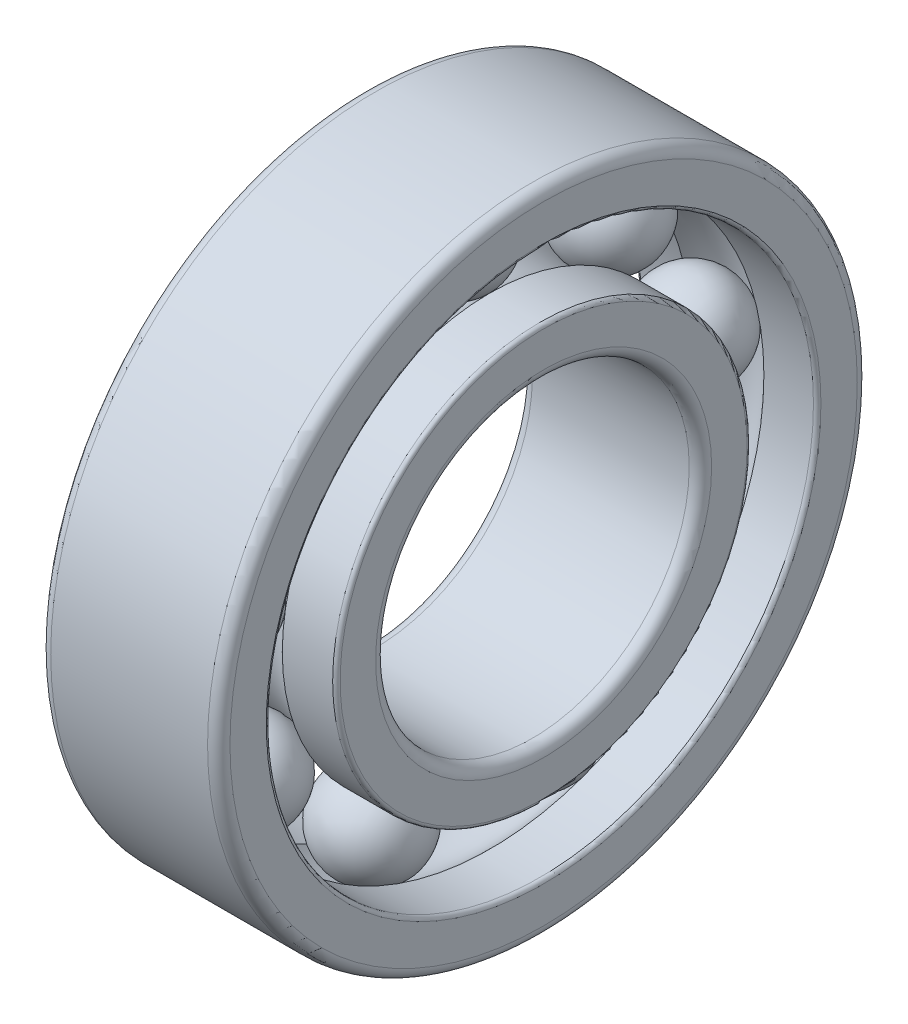
ISO-10303-21;
HEADER;
FILE_DESCRIPTION(('STEP AP214'),'2;1');
FILE_NAME('part.step','',(''),(''),'','','');
FILE_SCHEMA(('AUTOMOTIVE_DESIGN { 1 0 10303 214 1 1 1 1 }'));
ENDSEC;
DATA;
#1=APPLICATION_CONTEXT('core data for automotive mechanical design processes');
#2=APPLICATION_PROTOCOL_DEFINITION('international standard','automotive_design',2000,#1);
#3=PRODUCT_CONTEXT('',#1,'mechanical');
#4=PRODUCT('Part','Part','',(#3));
#5=PRODUCT_RELATED_PRODUCT_CATEGORY('part','',(#4));
#6=PRODUCT_DEFINITION_FORMATION('','',#4);
#7=PRODUCT_DEFINITION_CONTEXT('part definition',#1,'design');
#8=PRODUCT_DEFINITION('design','',#6,#7);
#9=PRODUCT_DEFINITION_SHAPE('','',#8);
#10=(LENGTH_UNIT() NAMED_UNIT(*) SI_UNIT(.MILLI.,.METRE.));
#11=(NAMED_UNIT(*) PLANE_ANGLE_UNIT() SI_UNIT($,.RADIAN.));
#12=(NAMED_UNIT(*) SI_UNIT($,.STERADIAN.) SOLID_ANGLE_UNIT());
#13=UNCERTAINTY_MEASURE_WITH_UNIT(LENGTH_MEASURE(1.E-05),#10,'distance_accuracy_value','');
#14=(GEOMETRIC_REPRESENTATION_CONTEXT(3) GLOBAL_UNCERTAINTY_ASSIGNED_CONTEXT((#13)) GLOBAL_UNIT_ASSIGNED_CONTEXT((#10,
#11,#12)) REPRESENTATION_CONTEXT('',''));
#15=CARTESIAN_POINT('',(0.,0.,0.));
#16=DIRECTION('',(0.,0.,1.));
#17=DIRECTION('',(1.,0.,0.));
#18=AXIS2_PLACEMENT_3D('',#15,#16,#17);
#19=CARTESIAN_POINT('',(0.,18.1666666666667,0.));
#20=DIRECTION('',(-1.,0.,0.));
#21=DIRECTION('',(0.,0.,1.));
#22=AXIS2_PLACEMENT_3D('',#19,#20,#21);
#23=PLANE('',#22);
#24=CARTESIAN_POINT('',(0.,0.,0.));
#25=DIRECTION('',(1.,0.,0.));
#26=DIRECTION('',(0.,0.,-1.));
#27=AXIS2_PLACEMENT_3D('',#24,#25,#26);
#28=CIRCLE('',#27,18.1666666667);
#29=CARTESIAN_POINT('',(0.,0.,-18.1666666666667));
#30=VERTEX_POINT('',#29);
#31=EDGE_CURVE('P0_E39',#30,#30,#28,.T.);
#32=ORIENTED_EDGE('',*,*,#31,.F.);
#33=EDGE_LOOP('',(#32));
#34=FACE_BOUND('',#33,.T.);
#35=CARTESIAN_POINT('',(0.,0.,0.));
#36=DIRECTION('',(1.,0.,0.));
#37=DIRECTION('',(0.,0.,-1.));
#38=AXIS2_PLACEMENT_3D('',#35,#36,#37);
#39=CIRCLE('',#38,15.);
#40=CARTESIAN_POINT('',(0.,0.,-15.));
#41=VERTEX_POINT('',#40);
#42=EDGE_CURVE('P0_E11',#41,#41,#39,.T.);
#43=ORIENTED_EDGE('',*,*,#42,.T.);
#44=EDGE_LOOP('',(#43));
#45=FACE_BOUND('',#44,.T.);
#46=ADVANCED_FACE('P0_F16',(#34,#45),#23,.T.);
#47=CARTESIAN_POINT('',(1.,0.,0.));
#48=DIRECTION('',(1.,0.,0.));
#49=DIRECTION('',(0.,0.,-1.));
#50=AXIS2_PLACEMENT_3D('',#47,#48,#49);
#51=TOROIDAL_SURFACE('',#50,15.,1.);
#52=ORIENTED_EDGE('',*,*,#42,.F.);
#53=EDGE_LOOP('',(#52));
#54=FACE_BOUND('',#53,.T.);
#55=CARTESIAN_POINT('',(1.,0.,0.));
#56=DIRECTION('',(1.,0.,0.));
#57=DIRECTION('',(0.,0.,-1.));
#58=AXIS2_PLACEMENT_3D('',#55,#56,#57);
#59=CIRCLE('',#58,14.);
#60=CARTESIAN_POINT('',(1.,0.,-14.));
#61=VERTEX_POINT('',#60);
#62=EDGE_CURVE('P0_E27',#61,#61,#59,.T.);
#63=ORIENTED_EDGE('',*,*,#62,.T.);
#64=EDGE_LOOP('',(#63));
#65=FACE_BOUND('',#64,.T.);
#66=ADVANCED_FACE('P0_F18',(#54,#65),#51,.T.);
#67=CARTESIAN_POINT('',(100.,0.,0.));
#68=DIRECTION('',(-1.,0.,0.));
#69=DIRECTION('',(0.,0.,-1.));
#70=AXIS2_PLACEMENT_3D('',#67,#68,#69);
#71=CYLINDRICAL_SURFACE('',#70,14.);
#72=ORIENTED_EDGE('',*,*,#62,.F.);
#73=EDGE_LOOP('',(#72));
#74=FACE_BOUND('',#73,.T.);
#75=CARTESIAN_POINT('',(15.,0.,0.));
#76=DIRECTION('',(1.,0.,0.));
#77=DIRECTION('',(0.,0.,-1.));
#78=AXIS2_PLACEMENT_3D('',#75,#76,#77);
#79=CIRCLE('',#78,14.);
#80=CARTESIAN_POINT('',(15.,0.,-14.));
#81=VERTEX_POINT('',#80);
#82=EDGE_CURVE('P0_E77',#81,#81,#79,.T.);
#83=ORIENTED_EDGE('',*,*,#82,.T.);
#84=EDGE_LOOP('',(#83));
#85=FACE_BOUND('',#84,.T.);
#86=ADVANCED_FACE('P0_F73',(#74,#85),#71,.F.);
#87=CARTESIAN_POINT('',(15.,0.,0.));
#88=DIRECTION('',(1.,0.,0.));
#89=DIRECTION('',(0.,0.,-1.));
#90=AXIS2_PLACEMENT_3D('',#87,#88,#89);
#91=TOROIDAL_SURFACE('',#90,15.,1.);
#92=ORIENTED_EDGE('',*,*,#82,.F.);
#93=EDGE_LOOP('',(#92));
#94=FACE_BOUND('',#93,.T.);
#95=CARTESIAN_POINT('',(16.,0.,0.));
#96=DIRECTION('',(1.,0.,0.));
#97=DIRECTION('',(0.,0.,-1.));
#98=AXIS2_PLACEMENT_3D('',#95,#96,#97);
#99=CIRCLE('',#98,15.);
#100=CARTESIAN_POINT('',(16.,0.,-15.));
#101=VERTEX_POINT('',#100);
#102=EDGE_CURVE('P0_E83',#101,#101,#99,.T.);
#103=ORIENTED_EDGE('',*,*,#102,.T.);
#104=EDGE_LOOP('',(#103));
#105=FACE_BOUND('',#104,.T.);
#106=ADVANCED_FACE('P0_F130',(#94,#105),#91,.T.);
#107=CARTESIAN_POINT('',(16.,15.,0.));
#108=DIRECTION('',(1.,0.,0.));
#109=DIRECTION('',(0.,1.,0.));
#110=AXIS2_PLACEMENT_3D('',#107,#108,#109);
#111=PLANE('',#110);
#112=CARTESIAN_POINT('',(16.,0.,0.));
#113=DIRECTION('',(1.,0.,0.));
#114=DIRECTION('',(0.,0.,-1.));
#115=AXIS2_PLACEMENT_3D('',#112,#113,#114);
#116=CIRCLE('',#115,18.1666666667);
#117=CARTESIAN_POINT('',(16.,0.,-18.1666666666667));
#118=VERTEX_POINT('',#117);
#119=EDGE_CURVE('P0_E94',#118,#118,#116,.T.);
#120=ORIENTED_EDGE('',*,*,#119,.T.);
#121=EDGE_LOOP('',(#120));
#122=FACE_BOUND('',#121,.T.);
#123=ORIENTED_EDGE('',*,*,#102,.F.);
#124=EDGE_LOOP('',(#123));
#125=FACE_BOUND('',#124,.T.);
#126=ADVANCED_FACE('P0_F134',(#122,#125),#111,.T.);
#127=CARTESIAN_POINT('',(15.6666666666667,0.,0.));
#128=DIRECTION('',(1.,0.,0.));
#129=DIRECTION('',(0.,0.,-1.));
#130=AXIS2_PLACEMENT_3D('',#127,#128,#129);
#131=TOROIDAL_SURFACE('',#130,18.1666666667,0.3333333333);
#132=ORIENTED_EDGE('',*,*,#119,.F.);
#133=EDGE_LOOP('',(#132));
#134=FACE_BOUND('',#133,.T.);
#135=CARTESIAN_POINT('',(15.6666666666667,0.,0.));
#136=DIRECTION('',(1.,0.,0.));
#137=DIRECTION('',(0.,0.,-1.));
#138=AXIS2_PLACEMENT_3D('',#135,#136,#137);
#139=CIRCLE('',#138,18.5);
#140=CARTESIAN_POINT('',(15.6666666666667,0.,-18.5));
#141=VERTEX_POINT('',#140);
#142=EDGE_CURVE('P0_E90',#141,#141,#139,.T.);
#143=ORIENTED_EDGE('',*,*,#142,.T.);
#144=EDGE_LOOP('',(#143));
#145=FACE_BOUND('',#144,.T.);
#146=ADVANCED_FACE('P0_F131',(#134,#145),#131,.T.);
#147=CARTESIAN_POINT('',(100.,0.,0.));
#148=DIRECTION('',(-1.,0.,0.));
#149=DIRECTION('',(0.,0.,-1.));
#150=AXIS2_PLACEMENT_3D('',#147,#148,#149);
#151=CYLINDRICAL_SURFACE('',#150,18.5);
#152=ORIENTED_EDGE('',*,*,#142,.F.);
#153=EDGE_LOOP('',(#152));
#154=FACE_BOUND('',#153,.T.);
#155=CARTESIAN_POINT('',(11.1713704056764,0.,0.));
#156=DIRECTION('',(1.,0.,0.));
#157=DIRECTION('',(0.,0.,-1.));
#158=AXIS2_PLACEMENT_3D('',#155,#156,#157);
#159=CIRCLE('',#158,18.5);
#160=CARTESIAN_POINT('',(11.1713704056764,0.,-18.5));
#161=VERTEX_POINT('',#160);
#162=EDGE_CURVE('P0_E20',#161,#161,#159,.T.);
#163=ORIENTED_EDGE('',*,*,#162,.T.);
#164=EDGE_LOOP('',(#163));
#165=FACE_BOUND('',#164,.T.);
#166=ADVANCED_FACE('P0_F133',(#154,#165),#151,.T.);
#167=CARTESIAN_POINT('',(8.,0.,0.));
#168=DIRECTION('',(1.,0.,0.));
#169=DIRECTION('',(0.,0.,-1.));
#170=AXIS2_PLACEMENT_3D('',#167,#168,#169);
#171=TOROIDAL_SURFACE('',#170,21.5,4.3655);
#172=CARTESIAN_POINT('',(4.82862959432362,0.,0.));
#173=DIRECTION('',(1.,0.,0.));
#174=DIRECTION('',(0.,0.,-1.));
#175=AXIS2_PLACEMENT_3D('',#172,#173,#174);
#176=CIRCLE('',#175,18.5);
#177=CARTESIAN_POINT('',(4.82862959432362,0.,-18.5));
#178=VERTEX_POINT('',#177);
#179=EDGE_CURVE('P0_E86',#178,#178,#176,.T.);
#180=ORIENTED_EDGE('',*,*,#179,.T.);
#181=EDGE_LOOP('',(#180));
#182=FACE_BOUND('',#181,.T.);
#183=ORIENTED_EDGE('',*,*,#162,.F.);
#184=EDGE_LOOP('',(#183));
#185=FACE_BOUND('',#184,.T.);
#186=ADVANCED_FACE('P0_F117',(#182,#185),#171,.F.);
#187=CARTESIAN_POINT('',(100.,0.,0.));
#188=DIRECTION('',(-1.,0.,0.));
#189=DIRECTION('',(0.,0.,-1.));
#190=AXIS2_PLACEMENT_3D('',#187,#188,#189);
#191=CYLINDRICAL_SURFACE('',#190,18.5);
#192=ORIENTED_EDGE('',*,*,#179,.F.);
#193=EDGE_LOOP('',(#192));
#194=FACE_BOUND('',#193,.T.);
#195=CARTESIAN_POINT('',(0.333333333333338,0.,0.));
#196=DIRECTION('',(1.,0.,0.));
#197=DIRECTION('',(0.,0.,-1.));
#198=AXIS2_PLACEMENT_3D('',#195,#196,#197);
#199=CIRCLE('',#198,18.5);
#200=CARTESIAN_POINT('',(0.333333333333338,0.,-18.5));
#201=VERTEX_POINT('',#200);
#202=EDGE_CURVE('P0_E89',#201,#201,#199,.T.);
#203=ORIENTED_EDGE('',*,*,#202,.T.);
#204=EDGE_LOOP('',(#203));
#205=FACE_BOUND('',#204,.T.);
#206=ADVANCED_FACE('P0_F109',(#194,#205),#191,.T.);
#207=CARTESIAN_POINT('',(0.333333333333323,0.,0.));
#208=DIRECTION('',(1.,0.,0.));
#209=DIRECTION('',(0.,0.,-1.));
#210=AXIS2_PLACEMENT_3D('',#207,#208,#209);
#211=TOROIDAL_SURFACE('',#210,18.1666666667,0.3333333333);
#212=ORIENTED_EDGE('',*,*,#202,.F.);
#213=EDGE_LOOP('',(#212));
#214=FACE_BOUND('',#213,.T.);
#215=ORIENTED_EDGE('',*,*,#31,.T.);
#216=EDGE_LOOP('',(#215));
#217=FACE_BOUND('',#216,.T.);
#218=ADVANCED_FACE('P0_F107',(#214,#217),#211,.T.);
#219=CLOSED_SHELL('',(#46,#66,#86,#106,#126,#146,#166,#186,#206,#218));
#220=MANIFOLD_SOLID_BREP('P0_B1',#219);
#221=CARTESIAN_POINT('',(1.,0.,0.));
#222=DIRECTION('',(1.,0.,0.));
#223=DIRECTION('',(0.,0.,-1.));
#224=AXIS2_PLACEMENT_3D('',#221,#222,#223);
#225=TOROIDAL_SURFACE('',#224,28.,1.);
#226=CARTESIAN_POINT('',(1.,0.,0.));
#227=DIRECTION('',(1.,0.,0.));
#228=DIRECTION('',(0.,0.,-1.));
#229=AXIS2_PLACEMENT_3D('',#226,#227,#228);
#230=CIRCLE('',#229,29.);
#231=CARTESIAN_POINT('',(1.,0.,-29.));
#232=VERTEX_POINT('',#231);
#233=EDGE_CURVE('P1_E39',#232,#232,#230,.T.);
#234=ORIENTED_EDGE('',*,*,#233,.F.);
#235=EDGE_LOOP('',(#234));
#236=FACE_BOUND('',#235,.T.);
#237=CARTESIAN_POINT('',(0.,0.,0.));
#238=DIRECTION('',(1.,0.,0.));
#239=DIRECTION('',(0.,0.,-1.));
#240=AXIS2_PLACEMENT_3D('',#237,#238,#239);
#241=CIRCLE('',#240,28.);
#242=CARTESIAN_POINT('',(0.,0.,-28.));
#243=VERTEX_POINT('',#242);
#244=EDGE_CURVE('P1_E11',#243,#243,#241,.T.);
#245=ORIENTED_EDGE('',*,*,#244,.T.);
#246=EDGE_LOOP('',(#245));
#247=FACE_BOUND('',#246,.T.);
#248=ADVANCED_FACE('P1_F16',(#236,#247),#225,.T.);
#249=CARTESIAN_POINT('',(0.,28.,0.));
#250=DIRECTION('',(-1.,0.,0.));
#251=DIRECTION('',(0.,0.,1.));
#252=AXIS2_PLACEMENT_3D('',#249,#250,#251);
#253=PLANE('',#252);
#254=ORIENTED_EDGE('',*,*,#244,.F.);
#255=EDGE_LOOP('',(#254));
#256=FACE_BOUND('',#255,.T.);
#257=CARTESIAN_POINT('',(0.,0.,0.));
#258=DIRECTION('',(1.,0.,0.));
#259=DIRECTION('',(0.,0.,-1.));
#260=AXIS2_PLACEMENT_3D('',#257,#258,#259);
#261=CIRCLE('',#260,24.7583333333);
#262=CARTESIAN_POINT('',(0.,0.,-24.7583333333333));
#263=VERTEX_POINT('',#262);
#264=EDGE_CURVE('P1_E27',#263,#263,#261,.T.);
#265=ORIENTED_EDGE('',*,*,#264,.T.);
#266=EDGE_LOOP('',(#265));
#267=FACE_BOUND('',#266,.T.);
#268=ADVANCED_FACE('P1_F127',(#256,#267),#253,.T.);
#269=CARTESIAN_POINT('',(0.333333333333335,0.,0.));
#270=DIRECTION('',(1.,0.,0.));
#271=DIRECTION('',(0.,0.,-1.));
#272=AXIS2_PLACEMENT_3D('',#269,#270,#271);
#273=TOROIDAL_SURFACE('',#272,24.7583333333,0.3333333333);
#274=ORIENTED_EDGE('',*,*,#264,.F.);
#275=EDGE_LOOP('',(#274));
#276=FACE_BOUND('',#275,.T.);
#277=CARTESIAN_POINT('',(0.333333333333331,0.,0.));
#278=DIRECTION('',(1.,0.,0.));
#279=DIRECTION('',(0.,0.,-1.));
#280=AXIS2_PLACEMENT_3D('',#277,#278,#279);
#281=CIRCLE('',#280,24.425);
#282=CARTESIAN_POINT('',(0.333333333333331,0.,-24.425));
#283=VERTEX_POINT('',#282);
#284=EDGE_CURVE('P1_E85',#283,#283,#281,.T.);
#285=ORIENTED_EDGE('',*,*,#284,.T.);
#286=EDGE_LOOP('',(#285));
#287=FACE_BOUND('',#286,.T.);
#288=ADVANCED_FACE('P1_F18',(#276,#287),#273,.T.);
#289=CARTESIAN_POINT('',(50.,0.,0.));
#290=DIRECTION('',(-1.,0.,0.));
#291=DIRECTION('',(0.,0.,-1.));
#292=AXIS2_PLACEMENT_3D('',#289,#290,#291);
#293=CYLINDRICAL_SURFACE('',#292,24.425);
#294=ORIENTED_EDGE('',*,*,#284,.F.);
#295=EDGE_LOOP('',(#294));
#296=FACE_BOUND('',#295,.T.);
#297=CARTESIAN_POINT('',(4.75932642032555,0.,0.));
#298=DIRECTION('',(1.,0.,0.));
#299=DIRECTION('',(0.,0.,-1.));
#300=AXIS2_PLACEMENT_3D('',#297,#298,#299);
#301=CIRCLE('',#300,24.425);
#302=CARTESIAN_POINT('',(4.75932642032555,0.,-24.425));
#303=VERTEX_POINT('',#302);
#304=EDGE_CURVE('P1_E80',#303,#303,#301,.T.);
#305=ORIENTED_EDGE('',*,*,#304,.T.);
#306=EDGE_LOOP('',(#305));
#307=FACE_BOUND('',#306,.T.);
#308=ADVANCED_FACE('P1_F131',(#296,#307),#293,.F.);
#309=CARTESIAN_POINT('',(8.,0.,0.));
#310=DIRECTION('',(1.,0.,0.));
#311=DIRECTION('',(0.,0.,-1.));
#312=AXIS2_PLACEMENT_3D('',#309,#310,#311);
#313=TOROIDAL_SURFACE('',#312,21.5,4.3655);
#314=CARTESIAN_POINT('',(11.2406735796744,0.,0.));
#315=DIRECTION('',(1.,0.,0.));
#316=DIRECTION('',(0.,0.,-1.));
#317=AXIS2_PLACEMENT_3D('',#314,#315,#316);
#318=CIRCLE('',#317,24.425);
#319=CARTESIAN_POINT('',(11.2406735796744,0.,-24.425));
#320=VERTEX_POINT('',#319);
#321=EDGE_CURVE('P1_E75',#320,#320,#318,.T.);
#322=ORIENTED_EDGE('',*,*,#321,.T.);
#323=EDGE_LOOP('',(#322));
#324=FACE_BOUND('',#323,.T.);
#325=ORIENTED_EDGE('',*,*,#304,.F.);
#326=EDGE_LOOP('',(#325));
#327=FACE_BOUND('',#326,.T.);
#328=CARTESIAN_POINT('',(8.,0.,-25.8655));
#329=VERTEX_POINT('',#328);
#330=VERTEX_LOOP('',#329);
#331=FACE_BOUND('',#330,.T.);
#332=ADVANCED_FACE('P1_F81',(#324,#327,#331),#313,.F.);
#333=CARTESIAN_POINT('',(50.,0.,0.));
#334=DIRECTION('',(-1.,0.,0.));
#335=DIRECTION('',(0.,0.,-1.));
#336=AXIS2_PLACEMENT_3D('',#333,#334,#335);
#337=CYLINDRICAL_SURFACE('',#336,24.425);
#338=ORIENTED_EDGE('',*,*,#321,.F.);
#339=EDGE_LOOP('',(#338));
#340=FACE_BOUND('',#339,.T.);
#341=CARTESIAN_POINT('',(15.6666666666667,0.,0.));
#342=DIRECTION('',(1.,0.,0.));
#343=DIRECTION('',(0.,0.,-1.));
#344=AXIS2_PLACEMENT_3D('',#341,#342,#343);
#345=CIRCLE('',#344,24.425);
#346=CARTESIAN_POINT('',(15.6666666666667,0.,-24.425));
#347=VERTEX_POINT('',#346);
#348=EDGE_CURVE('P1_E20',#347,#347,#345,.T.);
#349=ORIENTED_EDGE('',*,*,#348,.T.);
#350=EDGE_LOOP('',(#349));
#351=FACE_BOUND('',#350,.T.);
#352=ADVANCED_FACE('P1_F140',(#340,#351),#337,.F.);
#353=CARTESIAN_POINT('',(15.6666666666667,0.,0.));
#354=DIRECTION('',(1.,0.,0.));
#355=DIRECTION('',(0.,0.,-1.));
#356=AXIS2_PLACEMENT_3D('',#353,#354,#355);
#357=TOROIDAL_SURFACE('',#356,24.7583333333,0.3333333333);
#358=ORIENTED_EDGE('',*,*,#348,.F.);
#359=EDGE_LOOP('',(#358));
#360=FACE_BOUND('',#359,.T.);
#361=CARTESIAN_POINT('',(16.,0.,0.));
#362=DIRECTION('',(1.,0.,0.));
#363=DIRECTION('',(0.,0.,-1.));
#364=AXIS2_PLACEMENT_3D('',#361,#362,#363);
#365=CIRCLE('',#364,24.7583333333);
#366=CARTESIAN_POINT('',(16.,0.,-24.7583333333333));
#367=VERTEX_POINT('',#366);
#368=EDGE_CURVE('P1_E95',#367,#367,#365,.T.);
#369=ORIENTED_EDGE('',*,*,#368,.T.);
#370=EDGE_LOOP('',(#369));
#371=FACE_BOUND('',#370,.T.);
#372=ADVANCED_FACE('P1_F154',(#360,#371),#357,.T.);
#373=CARTESIAN_POINT('',(16.,24.7583333333333,0.));
#374=DIRECTION('',(1.,0.,0.));
#375=DIRECTION('',(0.,1.,0.));
#376=AXIS2_PLACEMENT_3D('',#373,#374,#375);
#377=PLANE('',#376);
#378=CARTESIAN_POINT('',(16.,0.,0.));
#379=DIRECTION('',(1.,0.,0.));
#380=DIRECTION('',(0.,0.,-1.));
#381=AXIS2_PLACEMENT_3D('',#378,#379,#380);
#382=CIRCLE('',#381,28.);
#383=CARTESIAN_POINT('',(16.,0.,-28.));
#384=VERTEX_POINT('',#383);
#385=EDGE_CURVE('P1_E98',#384,#384,#382,.T.);
#386=ORIENTED_EDGE('',*,*,#385,.T.);
#387=EDGE_LOOP('',(#386));
#388=FACE_BOUND('',#387,.T.);
#389=ORIENTED_EDGE('',*,*,#368,.F.);
#390=EDGE_LOOP('',(#389));
#391=FACE_BOUND('',#390,.T.);
#392=ADVANCED_FACE('P1_F108',(#388,#391),#377,.T.);
#393=CARTESIAN_POINT('',(15.,0.,0.));
#394=DIRECTION('',(1.,0.,0.));
#395=DIRECTION('',(0.,0.,-1.));
#396=AXIS2_PLACEMENT_3D('',#393,#394,#395);
#397=TOROIDAL_SURFACE('',#396,28.,1.);
#398=ORIENTED_EDGE('',*,*,#385,.F.);
#399=EDGE_LOOP('',(#398));
#400=FACE_BOUND('',#399,.T.);
#401=CARTESIAN_POINT('',(15.,0.,0.));
#402=DIRECTION('',(1.,0.,0.));
#403=DIRECTION('',(0.,0.,-1.));
#404=AXIS2_PLACEMENT_3D('',#401,#402,#403);
#405=CIRCLE('',#404,29.);
#406=CARTESIAN_POINT('',(15.,0.,-29.));
#407=VERTEX_POINT('',#406);
#408=EDGE_CURVE('P1_E99',#407,#407,#405,.T.);
#409=ORIENTED_EDGE('',*,*,#408,.T.);
#410=EDGE_LOOP('',(#409));
#411=FACE_BOUND('',#410,.T.);
#412=ADVANCED_FACE('P1_F111',(#400,#411),#397,.T.);
#413=CARTESIAN_POINT('',(50.,0.,0.));
#414=DIRECTION('',(-1.,0.,0.));
#415=DIRECTION('',(0.,0.,-1.));
#416=AXIS2_PLACEMENT_3D('',#413,#414,#415);
#417=CYLINDRICAL_SURFACE('',#416,29.);
#418=ORIENTED_EDGE('',*,*,#408,.F.);
#419=EDGE_LOOP('',(#418));
#420=FACE_BOUND('',#419,.T.);
#421=ORIENTED_EDGE('',*,*,#233,.T.);
#422=EDGE_LOOP('',(#421));
#423=FACE_BOUND('',#422,.T.);
#424=ADVANCED_FACE('P1_F114',(#420,#423),#417,.T.);
#425=CLOSED_SHELL('',(#248,#268,#288,#308,#332,#352,#372,#392,#412,#424));
#426=MANIFOLD_SOLID_BREP('P1_B1',#425);
#427=CARTESIAN_POINT('',(8.,21.5,0.));
#428=DIRECTION('',(1.,0.,0.));
#429=DIRECTION('',(0.,-1.,0.));
#430=AXIS2_PLACEMENT_3D('',#427,#428,#429);
#431=SPHERICAL_SURFACE('',#430,4.3655);
#432=CARTESIAN_POINT('',(12.3655,21.5,0.));
#433=VERTEX_POINT('',#432);
#434=VERTEX_LOOP('',#433);
#435=FACE_BOUND('',#434,.T.);
#436=CARTESIAN_POINT('',(3.6345,21.5,0.));
#437=VERTEX_POINT('',#436);
#438=VERTEX_LOOP('',#437);
#439=FACE_BOUND('',#438,.T.);
#440=ADVANCED_FACE('P2_F14',(#435,#439),#431,.T.);
#441=CLOSED_SHELL('',(#440));
#442=MANIFOLD_SOLID_BREP('P2_B1',#441);
#443=CARTESIAN_POINT('',(8.,16.469955527058,-13.8199336082606));
#444=DIRECTION('',(1.,0.,0.));
#445=DIRECTION('',(0.,-0.766044443118978,0.642787609686539));
#446=AXIS2_PLACEMENT_3D('',#443,#444,#445);
#447=SPHERICAL_SURFACE('',#446,4.3655);
#448=CARTESIAN_POINT('',(12.3655,16.469955527058,-13.8199336082606));
#449=VERTEX_POINT('',#448);
#450=VERTEX_LOOP('',#449);
#451=FACE_BOUND('',#450,.T.);
#452=CARTESIAN_POINT('',(3.6345,16.469955527058,-13.8199336082606));
#453=VERTEX_POINT('',#452);
#454=VERTEX_LOOP('',#453);
#455=FACE_BOUND('',#454,.T.);
#456=ADVANCED_FACE('P3_F14',(#451,#455),#447,.T.);
#457=CLOSED_SHELL('',(#456));
#458=MANIFOLD_SOLID_BREP('P3_B1',#457);
#459=CARTESIAN_POINT('',(8.,3.73343581983899,-21.1733666897625));
#460=DIRECTION('',(1.,0.,0.));
#461=DIRECTION('',(0.,-0.17364817766693,0.984807753012208));
#462=AXIS2_PLACEMENT_3D('',#459,#460,#461);
#463=SPHERICAL_SURFACE('',#462,4.3655);
#464=CARTESIAN_POINT('',(12.3655,3.73343581983899,-21.1733666897625));
#465=VERTEX_POINT('',#464);
#466=VERTEX_LOOP('',#465);
#467=FACE_BOUND('',#466,.T.);
#468=CARTESIAN_POINT('',(3.6345,3.73343581983899,-21.1733666897625));
#469=VERTEX_POINT('',#468);
#470=VERTEX_LOOP('',#469);
#471=FACE_BOUND('',#470,.T.);
#472=ADVANCED_FACE('P4_F14',(#467,#471),#463,.T.);
#473=CLOSED_SHELL('',(#472));
#474=MANIFOLD_SOLID_BREP('P4_B1',#473);
#475=CARTESIAN_POINT('',(8.,-10.75,-18.6195461813654));
#476=DIRECTION('',(1.,0.,0.));
#477=DIRECTION('',(0.,0.5,0.866025403784439));
#478=AXIS2_PLACEMENT_3D('',#475,#476,#477);
#479=SPHERICAL_SURFACE('',#478,4.3655);
#480=CARTESIAN_POINT('',(12.3655,-10.75,-18.6195461813654));
#481=VERTEX_POINT('',#480);
#482=VERTEX_LOOP('',#481);
#483=FACE_BOUND('',#482,.T.);
#484=CARTESIAN_POINT('',(3.6345,-10.75,-18.6195461813654));
#485=VERTEX_POINT('',#484);
#486=VERTEX_LOOP('',#485);
#487=FACE_BOUND('',#486,.T.);
#488=ADVANCED_FACE('P5_F14',(#483,#487),#479,.T.);
#489=CLOSED_SHELL('',(#488));
#490=MANIFOLD_SOLID_BREP('P5_B1',#489);
#491=CARTESIAN_POINT('',(8.,-20.203391346897,-7.35343308150188));
#492=DIRECTION('',(1.,0.,0.));
#493=DIRECTION('',(0.,0.939692620785908,0.342020143325669));
#494=AXIS2_PLACEMENT_3D('',#491,#492,#493);
#495=SPHERICAL_SURFACE('',#494,4.3655);
#496=CARTESIAN_POINT('',(12.3655,-20.203391346897,-7.35343308150188));
#497=VERTEX_POINT('',#496);
#498=VERTEX_LOOP('',#497);
#499=FACE_BOUND('',#498,.T.);
#500=CARTESIAN_POINT('',(3.6345,-20.203391346897,-7.35343308150188));
#501=VERTEX_POINT('',#500);
#502=VERTEX_LOOP('',#501);
#503=FACE_BOUND('',#502,.T.);
#504=ADVANCED_FACE('P6_F14',(#499,#503),#495,.T.);
#505=CLOSED_SHELL('',(#504));
#506=MANIFOLD_SOLID_BREP('P6_B1',#505);
#507=CARTESIAN_POINT('',(8.,-20.203391346897,7.35343308150188));
#508=DIRECTION('',(1.,0.,0.));
#509=DIRECTION('',(0.,0.939692620785908,-0.342020143325669));
#510=AXIS2_PLACEMENT_3D('',#507,#508,#509);
#511=SPHERICAL_SURFACE('',#510,4.3655);
#512=CARTESIAN_POINT('',(12.3655,-20.203391346897,7.35343308150188));
#513=VERTEX_POINT('',#512);
#514=VERTEX_LOOP('',#513);
#515=FACE_BOUND('',#514,.T.);
#516=CARTESIAN_POINT('',(3.6345,-20.203391346897,7.35343308150188));
#517=VERTEX_POINT('',#516);
#518=VERTEX_LOOP('',#517);
#519=FACE_BOUND('',#518,.T.);
#520=ADVANCED_FACE('P7_F14',(#515,#519),#511,.T.);
#521=CLOSED_SHELL('',(#520));
#522=MANIFOLD_SOLID_BREP('P7_B1',#521);
#523=CARTESIAN_POINT('',(8.,-10.75,18.6195461813654));
#524=DIRECTION('',(1.,0.,0.));
#525=DIRECTION('',(0.,0.5,-0.866025403784438));
#526=AXIS2_PLACEMENT_3D('',#523,#524,#525);
#527=SPHERICAL_SURFACE('',#526,4.3655);
#528=CARTESIAN_POINT('',(12.3655,-10.75,18.6195461813654));
#529=VERTEX_POINT('',#528);
#530=VERTEX_LOOP('',#529);
#531=FACE_BOUND('',#530,.T.);
#532=CARTESIAN_POINT('',(3.6345,-10.75,18.6195461813654));
#533=VERTEX_POINT('',#532);
#534=VERTEX_LOOP('',#533);
#535=FACE_BOUND('',#534,.T.);
#536=ADVANCED_FACE('P8_F14',(#531,#535),#527,.T.);
#537=CLOSED_SHELL('',(#536));
#538=MANIFOLD_SOLID_BREP('P8_B1',#537);
#539=CARTESIAN_POINT('',(8.,3.73343581983899,21.1733666897625));
#540=DIRECTION('',(1.,0.,0.));
#541=DIRECTION('',(0.,-0.17364817766693,-0.984807753012208));
#542=AXIS2_PLACEMENT_3D('',#539,#540,#541);
#543=SPHERICAL_SURFACE('',#542,4.3655);
#544=CARTESIAN_POINT('',(12.3655,3.73343581983899,21.1733666897625));
#545=VERTEX_POINT('',#544);
#546=VERTEX_LOOP('',#545);
#547=FACE_BOUND('',#546,.T.);
#548=CARTESIAN_POINT('',(3.6345,3.73343581983899,21.1733666897625));
#549=VERTEX_POINT('',#548);
#550=VERTEX_LOOP('',#549);
#551=FACE_BOUND('',#550,.T.);
#552=ADVANCED_FACE('P9_F14',(#547,#551),#543,.T.);
#553=CLOSED_SHELL('',(#552));
#554=MANIFOLD_SOLID_BREP('P9_B1',#553);
#555=CARTESIAN_POINT('',(8.,16.469955527058,13.8199336082606));
#556=DIRECTION('',(1.,0.,0.));
#557=DIRECTION('',(0.,-0.766044443118978,-0.64278760968654));
#558=AXIS2_PLACEMENT_3D('',#555,#556,#557);
#559=SPHERICAL_SURFACE('',#558,4.3655);
#560=CARTESIAN_POINT('',(12.3655,16.469955527058,13.8199336082606));
#561=VERTEX_POINT('',#560);
#562=VERTEX_LOOP('',#561);
#563=FACE_BOUND('',#562,.T.);
#564=CARTESIAN_POINT('',(3.6345,16.469955527058,13.8199336082606));
#565=VERTEX_POINT('',#564);
#566=VERTEX_LOOP('',#565);
#567=FACE_BOUND('',#566,.T.);
#568=ADVANCED_FACE('P10_F14',(#563,#567),#559,.T.);
#569=CLOSED_SHELL('',(#568));
#570=MANIFOLD_SOLID_BREP('P10_B1',#569);
#571=ADVANCED_BREP_SHAPE_REPRESENTATION('',(#18,#220,#426,#442,#458,#474,#490,#506,#522,#538,
#554,#570),#14);
#572=SHAPE_DEFINITION_REPRESENTATION(#9,#571);
ENDSEC;
END-ISO-10303-21;
